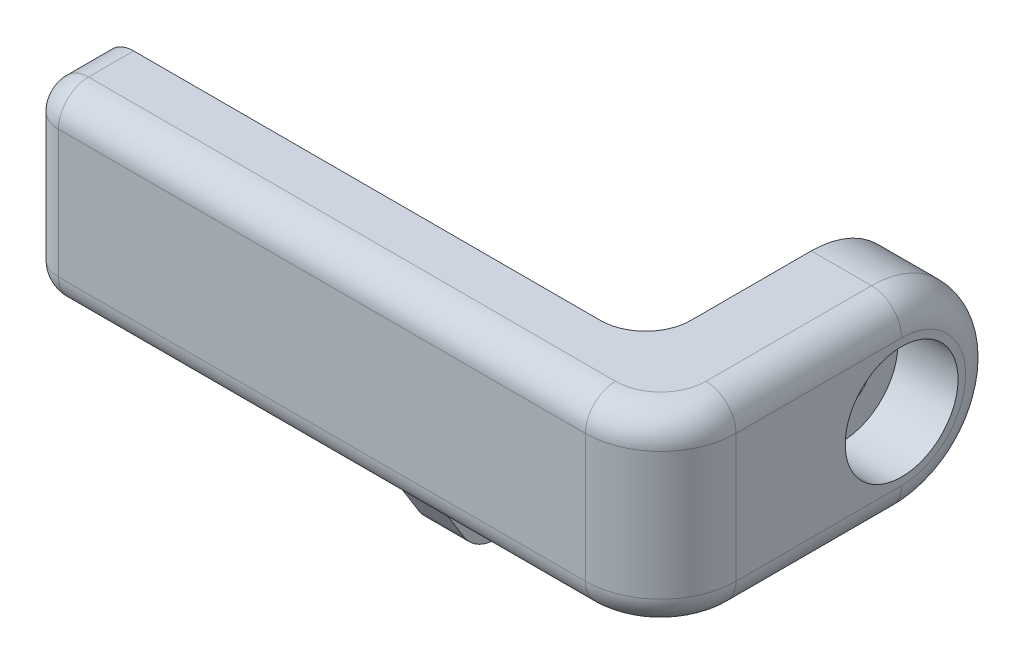
ISO-10303-21;
HEADER;
FILE_DESCRIPTION(('STEP AP214'),'2;1');
FILE_NAME('part.step','',(''),(''),'','','');
FILE_SCHEMA(('AUTOMOTIVE_DESIGN { 1 0 10303 214 1 1 1 1 }'));
ENDSEC;
DATA;
#1=APPLICATION_CONTEXT('core data for automotive mechanical design processes');
#2=APPLICATION_PROTOCOL_DEFINITION('international standard','automotive_design',2000,#1);
#3=PRODUCT_CONTEXT('',#1,'mechanical');
#4=PRODUCT('Part','Part','',(#3));
#5=PRODUCT_RELATED_PRODUCT_CATEGORY('part','',(#4));
#6=PRODUCT_DEFINITION_FORMATION('','',#4);
#7=PRODUCT_DEFINITION_CONTEXT('part definition',#1,'design');
#8=PRODUCT_DEFINITION('design','',#6,#7);
#9=PRODUCT_DEFINITION_SHAPE('','',#8);
#10=(LENGTH_UNIT() NAMED_UNIT(*) SI_UNIT(.MILLI.,.METRE.));
#11=(NAMED_UNIT(*) PLANE_ANGLE_UNIT() SI_UNIT($,.RADIAN.));
#12=(NAMED_UNIT(*) SI_UNIT($,.STERADIAN.) SOLID_ANGLE_UNIT());
#13=UNCERTAINTY_MEASURE_WITH_UNIT(LENGTH_MEASURE(1.E-05),#10,'distance_accuracy_value','');
#14=(GEOMETRIC_REPRESENTATION_CONTEXT(3) GLOBAL_UNCERTAINTY_ASSIGNED_CONTEXT((#13)) GLOBAL_UNIT_ASSIGNED_CONTEXT((#10,
#11,#12)) REPRESENTATION_CONTEXT('',''));
#15=CARTESIAN_POINT('',(0.,0.,0.));
#16=DIRECTION('',(0.,0.,1.));
#17=DIRECTION('',(1.,0.,0.));
#18=AXIS2_PLACEMENT_3D('',#15,#16,#17);
#19=CARTESIAN_POINT('',(0.,-12.5,32.));
#20=DIRECTION('',(0.,1.,0.));
#21=DIRECTION('',(0.,0.,1.));
#22=AXIS2_PLACEMENT_3D('',#19,#20,#21);
#23=PLANE('',#22);
#24=DIRECTION('',(0.,0.,-1.));
#25=VECTOR('',#24,1.);
#26=CARTESIAN_POINT('',(-29.,-12.5,28.));
#27=LINE('',#26,#25);
#28=CARTESIAN_POINT('',(-29.,-12.5,28.));
#29=VERTEX_POINT('',#28);
#30=CARTESIAN_POINT('',(-29.,-12.5,22.));
#31=VERTEX_POINT('',#30);
#32=EDGE_CURVE('E215',#29,#31,#27,.T.);
#33=ORIENTED_EDGE('',*,*,#32,.F.);
#34=DIRECTION('',(1.,0.,0.));
#35=VECTOR('',#34,1.);
#36=CARTESIAN_POINT('',(0.,-12.5,28.));
#37=LINE('',#36,#35);
#38=CARTESIAN_POINT('',(-68.,-12.5,28.));
#39=VERTEX_POINT('',#38);
#40=EDGE_CURVE('E230',#29,#39,#37,.F.);
#41=ORIENTED_EDGE('',*,*,#40,.T.);
#42=DIRECTION('',(0.,0.,1.));
#43=VECTOR('',#42,1.);
#44=CARTESIAN_POINT('',(-68.,-12.5,32.));
#45=LINE('',#44,#43);
#46=CARTESIAN_POINT('',(-68.,-12.5,22.));
#47=VERTEX_POINT('',#46);
#48=EDGE_CURVE('E246',#39,#47,#45,.F.);
#49=ORIENTED_EDGE('',*,*,#48,.T.);
#50=DIRECTION('',(1.,0.,0.));
#51=VECTOR('',#50,1.);
#52=CARTESIAN_POINT('',(-72.,-12.5,22.));
#53=LINE('',#52,#51);
#54=EDGE_CURVE('E233',#47,#31,#53,.T.);
#55=ORIENTED_EDGE('',*,*,#54,.T.);
#56=EDGE_LOOP('',(#33,#41,#49,#55));
#57=FACE_BOUND('',#56,.T.);
#58=ADVANCED_FACE('F45',(#57),#23,.F.);
#59=DIRECTION('',(0.,0.,-1.));
#60=VECTOR('',#59,1.);
#61=CARTESIAN_POINT('',(-23.,-12.5,28.));
#62=LINE('',#61,#60);
#63=CARTESIAN_POINT('',(-23.,-12.5,28.));
#64=VERTEX_POINT('',#63);
#65=CARTESIAN_POINT('',(-23.,-12.5,22.));
#66=VERTEX_POINT('',#65);
#67=EDGE_CURVE('E235',#64,#66,#62,.T.);
#68=ORIENTED_EDGE('',*,*,#67,.T.);
#69=CARTESIAN_POINT('',(-6.00000000000001,-12.5,22.));
#70=VERTEX_POINT('',#69);
#71=EDGE_CURVE('E397',#66,#70,#53,.T.);
#72=ORIENTED_EDGE('',*,*,#71,.T.);
#73=CARTESIAN_POINT('',(-6.00000000000001,-12.5,16.));
#74=DIRECTION('',(0.,1.,0.));
#75=DIRECTION('',(0.,0.,1.));
#76=AXIS2_PLACEMENT_3D('',#73,#74,#75);
#77=CIRCLE('',#76,6.);
#78=CARTESIAN_POINT('',(0.,-12.5,16.));
#79=VERTEX_POINT('',#78);
#80=EDGE_CURVE('E444',#70,#79,#77,.T.);
#81=ORIENTED_EDGE('',*,*,#80,.T.);
#82=DIRECTION('',(0.,0.,-1.));
#83=VECTOR('',#82,1.);
#84=CARTESIAN_POINT('',(0.,-12.5,32.));
#85=LINE('',#84,#83);
#86=CARTESIAN_POINT('',(0.,-12.5,0.));
#87=VERTEX_POINT('',#86);
#88=EDGE_CURVE('E414',#79,#87,#85,.T.);
#89=ORIENTED_EDGE('',*,*,#88,.T.);
#90=DIRECTION('',(1.,0.,0.));
#91=VECTOR('',#90,1.);
#92=CARTESIAN_POINT('',(0.,-12.5,0.));
#93=LINE('',#92,#91);
#94=CARTESIAN_POINT('',(8.,-12.5,0.));
#95=VERTEX_POINT('',#94);
#96=EDGE_CURVE('E403',#87,#95,#93,.T.);
#97=ORIENTED_EDGE('',*,*,#96,.T.);
#98=DIRECTION('',(0.,0.,-1.));
#99=VECTOR('',#98,1.);
#100=CARTESIAN_POINT('',(8.,-12.5,22.));
#101=LINE('',#100,#99);
#102=CARTESIAN_POINT('',(8.,-12.5,22.));
#103=VERTEX_POINT('',#102);
#104=EDGE_CURVE('E257',#95,#103,#101,.F.);
#105=ORIENTED_EDGE('',*,*,#104,.T.);
#106=CARTESIAN_POINT('',(2.,-12.5,22.));
#107=DIRECTION('',(0.,1.,0.));
#108=DIRECTION('',(0.,0.,1.));
#109=AXIS2_PLACEMENT_3D('',#106,#107,#108);
#110=CIRCLE('',#109,6.);
#111=CARTESIAN_POINT('',(2.,-12.5,28.));
#112=VERTEX_POINT('',#111);
#113=EDGE_CURVE('E250',#103,#112,#110,.F.);
#114=ORIENTED_EDGE('',*,*,#113,.T.);
#115=EDGE_CURVE('E245',#112,#64,#37,.F.);
#116=ORIENTED_EDGE('',*,*,#115,.T.);
#117=EDGE_LOOP('',(#68,#72,#81,#89,#97,#105,#114,#116));
#118=FACE_BOUND('',#117,.T.);
#119=ADVANCED_FACE('F541',(#118),#23,.F.);
#120=CARTESIAN_POINT('',(-72.,12.5,22.));
#121=DIRECTION('',(0.,0.,1.));
#122=DIRECTION('',(0.,-1.,0.));
#123=AXIS2_PLACEMENT_3D('',#120,#121,#122);
#124=PLANE('',#123);
#125=DIRECTION('',(0.,-1.,0.));
#126=VECTOR('',#125,1.);
#127=CARTESIAN_POINT('',(-23.,0.,22.));
#128=LINE('',#127,#126);
#129=CARTESIAN_POINT('',(-23.,0.,22.));
#130=VERTEX_POINT('',#129);
#131=EDGE_CURVE('E378',#130,#66,#128,.T.);
#132=ORIENTED_EDGE('',*,*,#131,.F.);
#133=DIRECTION('',(1.,0.,0.));
#134=VECTOR('',#133,1.);
#135=CARTESIAN_POINT('',(-23.,0.,22.));
#136=LINE('',#135,#134);
#137=CARTESIAN_POINT('',(-29.,0.,22.));
#138=VERTEX_POINT('',#137);
#139=EDGE_CURVE('E385',#138,#130,#136,.T.);
#140=ORIENTED_EDGE('',*,*,#139,.F.);
#141=DIRECTION('',(0.,1.,0.));
#142=VECTOR('',#141,1.);
#143=CARTESIAN_POINT('',(-29.,12.5,22.));
#144=LINE('',#143,#142);
#145=EDGE_CURVE('E287',#31,#138,#144,.T.);
#146=ORIENTED_EDGE('',*,*,#145,.F.);
#147=ORIENTED_EDGE('',*,*,#54,.F.);
#148=CARTESIAN_POINT('',(-68.,-8.5,22.));
#149=DIRECTION('',(0.,0.,1.));
#150=DIRECTION('',(0.,-1.,0.));
#151=AXIS2_PLACEMENT_3D('',#148,#149,#150);
#152=CIRCLE('',#151,4.);
#153=CARTESIAN_POINT('',(-72.,-8.49999999999999,22.));
#154=VERTEX_POINT('',#153);
#155=EDGE_CURVE('E284',#47,#154,#152,.F.);
#156=ORIENTED_EDGE('',*,*,#155,.T.);
#157=DIRECTION('',(0.,-1.,0.));
#158=VECTOR('',#157,1.);
#159=CARTESIAN_POINT('',(-72.,12.5,22.));
#160=LINE('',#159,#158);
#161=CARTESIAN_POINT('',(-72.,8.5,22.));
#162=VERTEX_POINT('',#161);
#163=EDGE_CURVE('E331',#162,#154,#160,.T.);
#164=ORIENTED_EDGE('',*,*,#163,.F.);
#165=CARTESIAN_POINT('',(-68.,8.5,22.));
#166=DIRECTION('',(0.,0.,1.));
#167=DIRECTION('',(0.,-1.,0.));
#168=AXIS2_PLACEMENT_3D('',#165,#166,#167);
#169=CIRCLE('',#168,4.);
#170=CARTESIAN_POINT('',(-68.,12.5,22.));
#171=VERTEX_POINT('',#170);
#172=EDGE_CURVE('E281',#162,#171,#169,.F.);
#173=ORIENTED_EDGE('',*,*,#172,.T.);
#174=DIRECTION('',(1.,0.,0.));
#175=VECTOR('',#174,1.);
#176=CARTESIAN_POINT('',(-72.,12.5,22.));
#177=LINE('',#176,#175);
#178=CARTESIAN_POINT('',(-6.00000000000001,12.5,22.));
#179=VERTEX_POINT('',#178);
#180=EDGE_CURVE('E400',#171,#179,#177,.T.);
#181=ORIENTED_EDGE('',*,*,#180,.T.);
#182=DIRECTION('',(0.,-1.,0.));
#183=VECTOR('',#182,1.);
#184=CARTESIAN_POINT('',(-6.00000000000001,-12.5,22.));
#185=LINE('',#184,#183);
#186=EDGE_CURVE('E437',#179,#70,#185,.T.);
#187=ORIENTED_EDGE('',*,*,#186,.T.);
#188=ORIENTED_EDGE('',*,*,#71,.F.);
#189=EDGE_LOOP('',(#132,#140,#146,#147,#156,#164,#173,#181,#187,#188));
#190=FACE_BOUND('',#189,.T.);
#191=ADVANCED_FACE('F522',(#190),#124,.F.);
#192=CARTESIAN_POINT('',(0.,0.,0.));
#193=DIRECTION('',(1.,0.,0.));
#194=DIRECTION('',(0.,0.,-1.));
#195=AXIS2_PLACEMENT_3D('',#192,#193,#194);
#196=PLANE('',#195);
#197=CARTESIAN_POINT('',(0.,0.,0.));
#198=DIRECTION('',(1.,0.,0.));
#199=DIRECTION('',(0.,0.,-1.));
#200=AXIS2_PLACEMENT_3D('',#197,#198,#199);
#201=CIRCLE('',#200,4.);
#202=CARTESIAN_POINT('',(0.,0.,-4.));
#203=VERTEX_POINT('',#202);
#204=EDGE_CURVE('E417',#203,#203,#201,.T.);
#205=ORIENTED_EDGE('',*,*,#204,.T.);
#206=EDGE_LOOP('',(#205));
#207=FACE_BOUND('',#206,.T.);
#208=ORIENTED_EDGE('',*,*,#88,.F.);
#209=DIRECTION('',(0.,-1.,0.));
#210=VECTOR('',#209,1.);
#211=CARTESIAN_POINT('',(0.,12.5,16.));
#212=LINE('',#211,#210);
#213=CARTESIAN_POINT('',(0.,12.5,16.));
#214=VERTEX_POINT('',#213);
#215=EDGE_CURVE('E441',#79,#214,#212,.F.);
#216=ORIENTED_EDGE('',*,*,#215,.T.);
#217=DIRECTION('',(0.,0.,-1.));
#218=VECTOR('',#217,1.);
#219=CARTESIAN_POINT('',(0.,12.5,32.));
#220=LINE('',#219,#218);
#221=CARTESIAN_POINT('',(0.,12.5,0.));
#222=VERTEX_POINT('',#221);
#223=EDGE_CURVE('E410',#214,#222,#220,.T.);
#224=ORIENTED_EDGE('',*,*,#223,.T.);
#225=CARTESIAN_POINT('',(0.,0.,0.));
#226=DIRECTION('',(1.,0.,0.));
#227=DIRECTION('',(0.,0.,-1.));
#228=AXIS2_PLACEMENT_3D('',#225,#226,#227);
#229=CIRCLE('',#228,12.5);
#230=EDGE_CURVE('E422',#87,#222,#229,.T.);
#231=ORIENTED_EDGE('',*,*,#230,.F.);
#232=EDGE_LOOP('',(#208,#216,#224,#231));
#233=FACE_BOUND('',#232,.T.);
#234=ADVANCED_FACE('F564',(#207,#233),#196,.F.);
#235=CARTESIAN_POINT('',(12.,0.,0.));
#236=DIRECTION('',(1.,0.,0.));
#237=DIRECTION('',(0.,0.,-1.));
#238=AXIS2_PLACEMENT_3D('',#235,#236,#237);
#239=PLANE('',#238);
#240=DIRECTION('',(0.,1.,0.));
#241=VECTOR('',#240,1.);
#242=CARTESIAN_POINT('',(12.,-12.5,22.));
#243=LINE('',#242,#241);
#244=CARTESIAN_POINT('',(12.,8.5,22.));
#245=VERTEX_POINT('',#244);
#246=CARTESIAN_POINT('',(12.,-8.5,22.));
#247=VERTEX_POINT('',#246);
#248=EDGE_CURVE('E455',#245,#247,#243,.F.);
#249=ORIENTED_EDGE('',*,*,#248,.T.);
#250=DIRECTION('',(0.,0.,-1.));
#251=VECTOR('',#250,1.);
#252=CARTESIAN_POINT('',(12.,-8.5,0.));
#253=LINE('',#252,#251);
#254=CARTESIAN_POINT('',(12.,-8.5,0.));
#255=VERTEX_POINT('',#254);
#256=EDGE_CURVE('E266',#247,#255,#253,.T.);
#257=ORIENTED_EDGE('',*,*,#256,.T.);
#258=CARTESIAN_POINT('',(12.,0.,0.));
#259=DIRECTION('',(1.,0.,0.));
#260=DIRECTION('',(0.,0.,-1.));
#261=AXIS2_PLACEMENT_3D('',#258,#259,#260);
#262=CIRCLE('',#261,8.5);
#263=CARTESIAN_POINT('',(12.,8.5,0.));
#264=VERTEX_POINT('',#263);
#265=EDGE_CURVE('E263',#255,#264,#262,.T.);
#266=ORIENTED_EDGE('',*,*,#265,.T.);
#267=DIRECTION('',(0.,0.,-1.));
#268=VECTOR('',#267,1.);
#269=CARTESIAN_POINT('',(12.,8.5,22.));
#270=LINE('',#269,#268);
#271=EDGE_CURVE('E260',#264,#245,#270,.F.);
#272=ORIENTED_EDGE('',*,*,#271,.T.);
#273=EDGE_LOOP('',(#249,#257,#266,#272));
#274=FACE_BOUND('',#273,.T.);
#275=CARTESIAN_POINT('',(12.,0.,0.));
#276=DIRECTION('',(1.,0.,0.));
#277=DIRECTION('',(0.,0.,-1.));
#278=AXIS2_PLACEMENT_3D('',#275,#276,#277);
#279=CIRCLE('',#278,7.5);
#280=CARTESIAN_POINT('',(12.,0.,-7.5));
#281=VERTEX_POINT('',#280);
#282=EDGE_CURVE('E426',#281,#281,#279,.T.);
#283=ORIENTED_EDGE('',*,*,#282,.F.);
#284=EDGE_LOOP('',(#283));
#285=FACE_BOUND('',#284,.T.);
#286=ADVANCED_FACE('F560',(#274,#285),#239,.T.);
#287=CARTESIAN_POINT('',(12.,0.,0.));
#288=DIRECTION('',(-1.,0.,0.));
#289=DIRECTION('',(0.,0.,1.));
#290=AXIS2_PLACEMENT_3D('',#287,#288,#289);
#291=CYLINDRICAL_SURFACE('',#290,7.5);
#292=ORIENTED_EDGE('',*,*,#282,.T.);
#293=EDGE_LOOP('',(#292));
#294=FACE_BOUND('',#293,.T.);
#295=CARTESIAN_POINT('',(4.,0.,0.));
#296=DIRECTION('',(1.,0.,0.));
#297=DIRECTION('',(0.,0.,-1.));
#298=AXIS2_PLACEMENT_3D('',#295,#296,#297);
#299=CIRCLE('',#298,7.5);
#300=CARTESIAN_POINT('',(4.,0.,-7.5));
#301=VERTEX_POINT('',#300);
#302=EDGE_CURVE('E430',#301,#301,#299,.T.);
#303=ORIENTED_EDGE('',*,*,#302,.F.);
#304=EDGE_LOOP('',(#303));
#305=FACE_BOUND('',#304,.T.);
#306=ADVANCED_FACE('F563',(#294,#305),#291,.F.);
#307=CARTESIAN_POINT('',(12.,0.,0.));
#308=DIRECTION('',(-1.,0.,0.));
#309=DIRECTION('',(0.,0.,1.));
#310=AXIS2_PLACEMENT_3D('',#307,#308,#309);
#311=CYLINDRICAL_SURFACE('',#310,12.5);
#312=DIRECTION('',(-1.,0.,0.));
#313=VECTOR('',#312,1.);
#314=CARTESIAN_POINT('',(0.,12.5,0.));
#315=LINE('',#314,#313);
#316=CARTESIAN_POINT('',(8.,12.5,0.));
#317=VERTEX_POINT('',#316);
#318=EDGE_CURVE('E407',#317,#222,#315,.T.);
#319=ORIENTED_EDGE('',*,*,#318,.F.);
#320=CARTESIAN_POINT('',(8.,0.,0.));
#321=DIRECTION('',(1.,0.,0.));
#322=DIRECTION('',(0.,0.,-1.));
#323=AXIS2_PLACEMENT_3D('',#320,#321,#322);
#324=CIRCLE('',#323,12.5);
#325=EDGE_CURVE('E269',#317,#95,#324,.F.);
#326=ORIENTED_EDGE('',*,*,#325,.T.);
#327=ORIENTED_EDGE('',*,*,#96,.F.);
#328=ORIENTED_EDGE('',*,*,#230,.T.);
#329=EDGE_LOOP('',(#319,#326,#327,#328));
#330=FACE_BOUND('',#329,.T.);
#331=ADVANCED_FACE('F558',(#330),#311,.T.);
#332=CARTESIAN_POINT('',(4.,0.,0.));
#333=DIRECTION('',(-1.,0.,0.));
#334=DIRECTION('',(0.,0.,1.));
#335=AXIS2_PLACEMENT_3D('',#332,#333,#334);
#336=CYLINDRICAL_SURFACE('',#335,4.);
#337=CARTESIAN_POINT('',(4.,0.,0.));
#338=DIRECTION('',(1.,0.,0.));
#339=DIRECTION('',(0.,0.,-1.));
#340=AXIS2_PLACEMENT_3D('',#337,#338,#339);
#341=CIRCLE('',#340,4.);
#342=CARTESIAN_POINT('',(4.,0.,-4.));
#343=VERTEX_POINT('',#342);
#344=EDGE_CURVE('E418',#343,#343,#341,.T.);
#345=ORIENTED_EDGE('',*,*,#344,.T.);
#346=EDGE_LOOP('',(#345));
#347=FACE_BOUND('',#346,.T.);
#348=ORIENTED_EDGE('',*,*,#204,.F.);
#349=EDGE_LOOP('',(#348));
#350=FACE_BOUND('',#349,.T.);
#351=ADVANCED_FACE('F554',(#347,#350),#336,.F.);
#352=CARTESIAN_POINT('',(4.,0.,0.));
#353=DIRECTION('',(1.,0.,0.));
#354=DIRECTION('',(0.,0.,-1.));
#355=AXIS2_PLACEMENT_3D('',#352,#353,#354);
#356=PLANE('',#355);
#357=ORIENTED_EDGE('',*,*,#302,.T.);
#358=EDGE_LOOP('',(#357));
#359=FACE_BOUND('',#358,.T.);
#360=ORIENTED_EDGE('',*,*,#344,.F.);
#361=EDGE_LOOP('',(#360));
#362=FACE_BOUND('',#361,.T.);
#363=ADVANCED_FACE('F551',(#359,#362),#356,.T.);
#364=CARTESIAN_POINT('',(0.,12.5,32.));
#365=DIRECTION('',(0.,-1.,0.));
#366=DIRECTION('',(0.,0.,-1.));
#367=AXIS2_PLACEMENT_3D('',#364,#365,#366);
#368=PLANE('',#367);
#369=ORIENTED_EDGE('',*,*,#180,.F.);
#370=DIRECTION('',(0.,0.,-1.));
#371=VECTOR('',#370,1.);
#372=CARTESIAN_POINT('',(-68.,12.5,32.));
#373=LINE('',#372,#371);
#374=CARTESIAN_POINT('',(-68.,12.5,28.));
#375=VERTEX_POINT('',#374);
#376=EDGE_CURVE('E479',#171,#375,#373,.F.);
#377=ORIENTED_EDGE('',*,*,#376,.T.);
#378=DIRECTION('',(-1.,0.,0.));
#379=VECTOR('',#378,1.);
#380=CARTESIAN_POINT('',(0.,12.5,28.));
#381=LINE('',#380,#379);
#382=CARTESIAN_POINT('',(2.,12.5,28.));
#383=VERTEX_POINT('',#382);
#384=EDGE_CURVE('E475',#375,#383,#381,.F.);
#385=ORIENTED_EDGE('',*,*,#384,.T.);
#386=CARTESIAN_POINT('',(2.,12.5,22.));
#387=DIRECTION('',(0.,-1.,0.));
#388=DIRECTION('',(0.,0.,-1.));
#389=AXIS2_PLACEMENT_3D('',#386,#387,#388);
#390=CIRCLE('',#389,6.);
#391=CARTESIAN_POINT('',(8.,12.5,22.));
#392=VERTEX_POINT('',#391);
#393=EDGE_CURVE('E472',#383,#392,#390,.F.);
#394=ORIENTED_EDGE('',*,*,#393,.T.);
#395=DIRECTION('',(0.,0.,-1.));
#396=VECTOR('',#395,1.);
#397=CARTESIAN_POINT('',(8.,12.5,0.));
#398=LINE('',#397,#396);
#399=EDGE_CURVE('E469',#392,#317,#398,.T.);
#400=ORIENTED_EDGE('',*,*,#399,.T.);
#401=ORIENTED_EDGE('',*,*,#318,.T.);
#402=ORIENTED_EDGE('',*,*,#223,.F.);
#403=CARTESIAN_POINT('',(-6.00000000000001,12.5,16.));
#404=DIRECTION('',(0.,-1.,0.));
#405=DIRECTION('',(0.,0.,-1.));
#406=AXIS2_PLACEMENT_3D('',#403,#404,#405);
#407=CIRCLE('',#406,6.);
#408=EDGE_CURVE('E447',#214,#179,#407,.T.);
#409=ORIENTED_EDGE('',*,*,#408,.T.);
#410=EDGE_LOOP('',(#369,#377,#385,#394,#400,#401,#402,#409));
#411=FACE_BOUND('',#410,.T.);
#412=ADVANCED_FACE('F549',(#411),#368,.F.);
#413=CARTESIAN_POINT('',(0.,0.,32.));
#414=DIRECTION('',(0.,0.,-1.));
#415=DIRECTION('',(-1.,0.,0.));
#416=AXIS2_PLACEMENT_3D('',#413,#414,#415);
#417=PLANE('',#416);
#418=DIRECTION('',(0.,1.,0.));
#419=VECTOR('',#418,1.);
#420=CARTESIAN_POINT('',(2.,12.5,32.));
#421=LINE('',#420,#419);
#422=CARTESIAN_POINT('',(2.,-8.5,32.));
#423=VERTEX_POINT('',#422);
#424=CARTESIAN_POINT('',(2.,8.5,32.));
#425=VERTEX_POINT('',#424);
#426=EDGE_CURVE('E451',#423,#425,#421,.T.);
#427=ORIENTED_EDGE('',*,*,#426,.T.);
#428=DIRECTION('',(-1.,0.,0.));
#429=VECTOR('',#428,1.);
#430=CARTESIAN_POINT('',(0.,8.5,32.));
#431=LINE('',#430,#429);
#432=CARTESIAN_POINT('',(-68.,8.5,32.));
#433=VERTEX_POINT('',#432);
#434=EDGE_CURVE('E465',#425,#433,#431,.T.);
#435=ORIENTED_EDGE('',*,*,#434,.T.);
#436=DIRECTION('',(0.,1.,0.));
#437=VECTOR('',#436,1.);
#438=CARTESIAN_POINT('',(-68.,0.,32.));
#439=LINE('',#438,#437);
#440=CARTESIAN_POINT('',(-68.,-8.5,32.));
#441=VERTEX_POINT('',#440);
#442=EDGE_CURVE('E459',#433,#441,#439,.F.);
#443=ORIENTED_EDGE('',*,*,#442,.T.);
#444=DIRECTION('',(1.,0.,0.));
#445=VECTOR('',#444,1.);
#446=CARTESIAN_POINT('',(0.,-8.5,32.));
#447=LINE('',#446,#445);
#448=EDGE_CURVE('E462',#441,#423,#447,.T.);
#449=ORIENTED_EDGE('',*,*,#448,.T.);
#450=EDGE_LOOP('',(#427,#435,#443,#449));
#451=FACE_BOUND('',#450,.T.);
#452=ADVANCED_FACE('F495',(#451),#417,.F.);
#453=CARTESIAN_POINT('',(-72.,0.,0.));
#454=DIRECTION('',(1.,0.,0.));
#455=DIRECTION('',(0.,0.,-1.));
#456=AXIS2_PLACEMENT_3D('',#453,#454,#455);
#457=PLANE('',#456);
#458=ORIENTED_EDGE('',*,*,#163,.T.);
#459=DIRECTION('',(0.,0.,1.));
#460=VECTOR('',#459,1.);
#461=CARTESIAN_POINT('',(-72.,-8.5,0.));
#462=LINE('',#461,#460);
#463=CARTESIAN_POINT('',(-72.,-8.5,28.));
#464=VERTEX_POINT('',#463);
#465=EDGE_CURVE('E278',#154,#464,#462,.T.);
#466=ORIENTED_EDGE('',*,*,#465,.T.);
#467=DIRECTION('',(0.,1.,0.));
#468=VECTOR('',#467,1.);
#469=CARTESIAN_POINT('',(-72.,0.,28.));
#470=LINE('',#469,#468);
#471=CARTESIAN_POINT('',(-72.,8.5,28.));
#472=VERTEX_POINT('',#471);
#473=EDGE_CURVE('E272',#464,#472,#470,.T.);
#474=ORIENTED_EDGE('',*,*,#473,.T.);
#475=DIRECTION('',(0.,0.,-1.));
#476=VECTOR('',#475,1.);
#477=CARTESIAN_POINT('',(-72.,8.5,0.));
#478=LINE('',#477,#476);
#479=EDGE_CURVE('E275',#472,#162,#478,.T.);
#480=ORIENTED_EDGE('',*,*,#479,.T.);
#481=EDGE_LOOP('',(#458,#466,#474,#480));
#482=FACE_BOUND('',#481,.T.);
#483=ADVANCED_FACE('F578',(#482),#457,.F.);
#484=CARTESIAN_POINT('',(-6.00000000000001,12.5,16.));
#485=DIRECTION('',(0.,1.,0.));
#486=DIRECTION('',(0.,0.,1.));
#487=AXIS2_PLACEMENT_3D('',#484,#485,#486);
#488=CYLINDRICAL_SURFACE('',#487,6.);
#489=ORIENTED_EDGE('',*,*,#408,.F.);
#490=ORIENTED_EDGE('',*,*,#215,.F.);
#491=ORIENTED_EDGE('',*,*,#80,.F.);
#492=ORIENTED_EDGE('',*,*,#186,.F.);
#493=EDGE_LOOP('',(#489,#490,#491,#492));
#494=FACE_BOUND('',#493,.T.);
#495=ADVANCED_FACE('F575',(#494),#488,.F.);
#496=CARTESIAN_POINT('',(2.,0.,22.));
#497=DIRECTION('',(0.,-1.,0.));
#498=DIRECTION('',(0.,0.,-1.));
#499=AXIS2_PLACEMENT_3D('',#496,#497,#498);
#500=CYLINDRICAL_SURFACE('',#499,10.);
#501=ORIENTED_EDGE('',*,*,#248,.F.);
#502=CARTESIAN_POINT('',(2.,8.5,22.));
#503=DIRECTION('',(0.,-1.,0.));
#504=DIRECTION('',(0.,0.,-1.));
#505=AXIS2_PLACEMENT_3D('',#502,#503,#504);
#506=CIRCLE('',#505,10.);
#507=EDGE_CURVE('E251',#245,#425,#506,.T.);
#508=ORIENTED_EDGE('',*,*,#507,.T.);
#509=ORIENTED_EDGE('',*,*,#426,.F.);
#510=CARTESIAN_POINT('',(2.,-8.5,22.));
#511=DIRECTION('',(0.,1.,0.));
#512=DIRECTION('',(0.,0.,1.));
#513=AXIS2_PLACEMENT_3D('',#510,#511,#512);
#514=CIRCLE('',#513,10.);
#515=EDGE_CURVE('E482',#423,#247,#514,.T.);
#516=ORIENTED_EDGE('',*,*,#515,.T.);
#517=EDGE_LOOP('',(#501,#508,#509,#516));
#518=FACE_BOUND('',#517,.T.);
#519=ADVANCED_FACE('F489',(#518),#500,.T.);
#520=CARTESIAN_POINT('',(2.,-8.5,22.));
#521=DIRECTION('',(0.,1.,0.));
#522=DIRECTION('',(0.,0.,1.));
#523=AXIS2_PLACEMENT_3D('',#520,#521,#522);
#524=TOROIDAL_SURFACE('',#523,6.,4.);
#525=CARTESIAN_POINT('',(2.,-8.5,28.));
#526=DIRECTION('',(-1.,0.,0.));
#527=DIRECTION('',(0.,0.,1.));
#528=AXIS2_PLACEMENT_3D('',#525,#526,#527);
#529=CIRCLE('',#528,4.);
#530=EDGE_CURVE('E324',#112,#423,#529,.T.);
#531=ORIENTED_EDGE('',*,*,#530,.F.);
#532=ORIENTED_EDGE('',*,*,#113,.F.);
#533=CARTESIAN_POINT('',(8.,-8.5,22.));
#534=DIRECTION('',(0.,0.,-1.));
#535=DIRECTION('',(-1.,0.,0.));
#536=AXIS2_PLACEMENT_3D('',#533,#534,#535);
#537=CIRCLE('',#536,4.);
#538=EDGE_CURVE('E327',#247,#103,#537,.T.);
#539=ORIENTED_EDGE('',*,*,#538,.F.);
#540=ORIENTED_EDGE('',*,*,#515,.F.);
#541=EDGE_LOOP('',(#531,#532,#539,#540));
#542=FACE_BOUND('',#541,.T.);
#543=ADVANCED_FACE('F581',(#542),#524,.T.);
#544=CARTESIAN_POINT('',(8.,-8.5,0.));
#545=DIRECTION('',(0.,0.,1.));
#546=DIRECTION('',(1.,0.,0.));
#547=AXIS2_PLACEMENT_3D('',#544,#545,#546);
#548=CYLINDRICAL_SURFACE('',#547,4.);
#549=ORIENTED_EDGE('',*,*,#538,.T.);
#550=ORIENTED_EDGE('',*,*,#104,.F.);
#551=CARTESIAN_POINT('',(8.,-8.5,0.));
#552=DIRECTION('',(0.,0.,-1.));
#553=DIRECTION('',(-1.,0.,0.));
#554=AXIS2_PLACEMENT_3D('',#551,#552,#553);
#555=CIRCLE('',#554,4.);
#556=EDGE_CURVE('E320',#255,#95,#555,.T.);
#557=ORIENTED_EDGE('',*,*,#556,.F.);
#558=ORIENTED_EDGE('',*,*,#256,.F.);
#559=EDGE_LOOP('',(#549,#550,#557,#558));
#560=FACE_BOUND('',#559,.T.);
#561=ADVANCED_FACE('F607',(#560),#548,.T.);
#562=CARTESIAN_POINT('',(0.,-8.5,28.));
#563=DIRECTION('',(1.,0.,0.));
#564=DIRECTION('',(0.,0.,-1.));
#565=AXIS2_PLACEMENT_3D('',#562,#563,#564);
#566=CYLINDRICAL_SURFACE('',#565,4.);
#567=ORIENTED_EDGE('',*,*,#530,.T.);
#568=ORIENTED_EDGE('',*,*,#448,.F.);
#569=CARTESIAN_POINT('',(-68.,-8.5,28.));
#570=DIRECTION('',(-1.,0.,0.));
#571=DIRECTION('',(0.,0.,1.));
#572=AXIS2_PLACEMENT_3D('',#569,#570,#571);
#573=CIRCLE('',#572,4.);
#574=EDGE_CURVE('E242',#39,#441,#573,.T.);
#575=ORIENTED_EDGE('',*,*,#574,.F.);
#576=ORIENTED_EDGE('',*,*,#40,.F.);
#577=DIRECTION('',(-1.,0.,0.));
#578=VECTOR('',#577,1.);
#579=CARTESIAN_POINT('',(-29.,-12.5,28.));
#580=LINE('',#579,#578);
#581=EDGE_CURVE('E202',#64,#29,#580,.T.);
#582=ORIENTED_EDGE('',*,*,#581,.F.);
#583=ORIENTED_EDGE('',*,*,#115,.F.);
#584=EDGE_LOOP('',(#567,#568,#575,#576,#582,#583));
#585=FACE_BOUND('',#584,.T.);
#586=ADVANCED_FACE('F239',(#585),#566,.T.);
#587=CARTESIAN_POINT('',(-68.,-8.5,0.));
#588=DIRECTION('',(0.,0.,1.));
#589=DIRECTION('',(1.,0.,0.));
#590=AXIS2_PLACEMENT_3D('',#587,#588,#589);
#591=CYLINDRICAL_SURFACE('',#590,4.);
#592=ORIENTED_EDGE('',*,*,#155,.F.);
#593=ORIENTED_EDGE('',*,*,#48,.F.);
#594=CARTESIAN_POINT('',(-68.,-8.5,28.));
#595=DIRECTION('',(0.,0.,1.));
#596=DIRECTION('',(1.,0.,0.));
#597=AXIS2_PLACEMENT_3D('',#594,#595,#596);
#598=CIRCLE('',#597,4.);
#599=EDGE_CURVE('E315',#464,#39,#598,.T.);
#600=ORIENTED_EDGE('',*,*,#599,.F.);
#601=ORIENTED_EDGE('',*,*,#465,.F.);
#602=EDGE_LOOP('',(#592,#593,#600,#601));
#603=FACE_BOUND('',#602,.T.);
#604=ADVANCED_FACE('F519',(#603),#591,.T.);
#605=CARTESIAN_POINT('',(8.,0.,0.));
#606=DIRECTION('',(1.,0.,0.));
#607=DIRECTION('',(0.,0.,-1.));
#608=AXIS2_PLACEMENT_3D('',#605,#606,#607);
#609=TOROIDAL_SURFACE('',#608,8.5,4.);
#610=ORIENTED_EDGE('',*,*,#556,.T.);
#611=ORIENTED_EDGE('',*,*,#325,.F.);
#612=CARTESIAN_POINT('',(8.,8.5,0.));
#613=DIRECTION('',(0.,0.,1.));
#614=DIRECTION('',(1.,0.,0.));
#615=AXIS2_PLACEMENT_3D('',#612,#613,#614);
#616=CIRCLE('',#615,4.);
#617=EDGE_CURVE('E311',#264,#317,#616,.T.);
#618=ORIENTED_EDGE('',*,*,#617,.F.);
#619=ORIENTED_EDGE('',*,*,#265,.F.);
#620=EDGE_LOOP('',(#610,#611,#618,#619));
#621=FACE_BOUND('',#620,.T.);
#622=ADVANCED_FACE('F599',(#621),#609,.T.);
#623=CARTESIAN_POINT('',(-68.,-8.5,28.));
#624=DIRECTION('',(0.,-1.,0.));
#625=DIRECTION('',(0.,0.,-1.));
#626=AXIS2_PLACEMENT_3D('',#623,#624,#625);
#627=SPHERICAL_SURFACE('',#626,4.);
#628=ORIENTED_EDGE('',*,*,#599,.T.);
#629=ORIENTED_EDGE('',*,*,#574,.T.);
#630=CARTESIAN_POINT('',(-68.,-8.5,28.));
#631=DIRECTION('',(0.,-1.,0.));
#632=DIRECTION('',(0.,0.,-1.));
#633=AXIS2_PLACEMENT_3D('',#630,#631,#632);
#634=CIRCLE('',#633,4.);
#635=EDGE_CURVE('E307',#464,#441,#634,.F.);
#636=ORIENTED_EDGE('',*,*,#635,.F.);
#637=EDGE_LOOP('',(#628,#629,#636));
#638=FACE_BOUND('',#637,.T.);
#639=ADVANCED_FACE('F514',(#638),#627,.T.);
#640=CARTESIAN_POINT('',(8.,8.5,32.));
#641=DIRECTION('',(0.,0.,1.));
#642=DIRECTION('',(1.,0.,0.));
#643=AXIS2_PLACEMENT_3D('',#640,#641,#642);
#644=CYLINDRICAL_SURFACE('',#643,4.);
#645=ORIENTED_EDGE('',*,*,#617,.T.);
#646=ORIENTED_EDGE('',*,*,#399,.F.);
#647=CARTESIAN_POINT('',(8.,8.5,22.));
#648=DIRECTION('',(0.,0.,1.));
#649=DIRECTION('',(1.,0.,0.));
#650=AXIS2_PLACEMENT_3D('',#647,#648,#649);
#651=CIRCLE('',#650,4.);
#652=EDGE_CURVE('E303',#245,#392,#651,.T.);
#653=ORIENTED_EDGE('',*,*,#652,.F.);
#654=ORIENTED_EDGE('',*,*,#271,.F.);
#655=EDGE_LOOP('',(#645,#646,#653,#654));
#656=FACE_BOUND('',#655,.T.);
#657=ADVANCED_FACE('F593',(#656),#644,.T.);
#658=CARTESIAN_POINT('',(-68.,0.,28.));
#659=DIRECTION('',(0.,1.,0.));
#660=DIRECTION('',(0.,0.,1.));
#661=AXIS2_PLACEMENT_3D('',#658,#659,#660);
#662=CYLINDRICAL_SURFACE('',#661,4.);
#663=ORIENTED_EDGE('',*,*,#635,.T.);
#664=ORIENTED_EDGE('',*,*,#442,.F.);
#665=CARTESIAN_POINT('',(-68.,8.5,28.));
#666=DIRECTION('',(0.,1.,0.));
#667=DIRECTION('',(0.,0.,1.));
#668=AXIS2_PLACEMENT_3D('',#665,#666,#667);
#669=CIRCLE('',#668,4.);
#670=EDGE_CURVE('E299',#472,#433,#669,.T.);
#671=ORIENTED_EDGE('',*,*,#670,.F.);
#672=ORIENTED_EDGE('',*,*,#473,.F.);
#673=EDGE_LOOP('',(#663,#664,#671,#672));
#674=FACE_BOUND('',#673,.T.);
#675=ADVANCED_FACE('F510',(#674),#662,.T.);
#676=CARTESIAN_POINT('',(-68.,8.5,0.));
#677=DIRECTION('',(0.,0.,-1.));
#678=DIRECTION('',(-1.,0.,0.));
#679=AXIS2_PLACEMENT_3D('',#676,#677,#678);
#680=CYLINDRICAL_SURFACE('',#679,4.);
#681=ORIENTED_EDGE('',*,*,#172,.F.);
#682=ORIENTED_EDGE('',*,*,#479,.F.);
#683=CARTESIAN_POINT('',(-68.,8.5,28.));
#684=DIRECTION('',(0.,0.,1.));
#685=DIRECTION('',(1.,0.,0.));
#686=AXIS2_PLACEMENT_3D('',#683,#684,#685);
#687=CIRCLE('',#686,4.);
#688=EDGE_CURVE('E295',#375,#472,#687,.T.);
#689=ORIENTED_EDGE('',*,*,#688,.F.);
#690=ORIENTED_EDGE('',*,*,#376,.F.);
#691=EDGE_LOOP('',(#681,#682,#689,#690));
#692=FACE_BOUND('',#691,.T.);
#693=ADVANCED_FACE('F587',(#692),#680,.T.);
#694=CARTESIAN_POINT('',(2.,8.5,22.));
#695=DIRECTION('',(0.,-1.,0.));
#696=DIRECTION('',(0.,0.,-1.));
#697=AXIS2_PLACEMENT_3D('',#694,#695,#696);
#698=TOROIDAL_SURFACE('',#697,6.,4.);
#699=ORIENTED_EDGE('',*,*,#652,.T.);
#700=ORIENTED_EDGE('',*,*,#393,.F.);
#701=CARTESIAN_POINT('',(2.,8.5,28.));
#702=DIRECTION('',(-1.,0.,0.));
#703=DIRECTION('',(0.,0.,1.));
#704=AXIS2_PLACEMENT_3D('',#701,#702,#703);
#705=CIRCLE('',#704,4.);
#706=EDGE_CURVE('E291',#425,#383,#705,.T.);
#707=ORIENTED_EDGE('',*,*,#706,.F.);
#708=ORIENTED_EDGE('',*,*,#507,.F.);
#709=EDGE_LOOP('',(#699,#700,#707,#708));
#710=FACE_BOUND('',#709,.T.);
#711=ADVANCED_FACE('F498',(#710),#698,.T.);
#712=CARTESIAN_POINT('',(-68.,8.5,28.));
#713=DIRECTION('',(-1.,0.,0.));
#714=DIRECTION('',(0.,0.,1.));
#715=AXIS2_PLACEMENT_3D('',#712,#713,#714);
#716=SPHERICAL_SURFACE('',#715,4.);
#717=ORIENTED_EDGE('',*,*,#688,.T.);
#718=ORIENTED_EDGE('',*,*,#670,.T.);
#719=CARTESIAN_POINT('',(-68.,8.5,28.));
#720=DIRECTION('',(-1.,0.,0.));
#721=DIRECTION('',(0.,0.,1.));
#722=AXIS2_PLACEMENT_3D('',#719,#720,#721);
#723=CIRCLE('',#722,4.);
#724=EDGE_CURVE('E288',#375,#433,#723,.F.);
#725=ORIENTED_EDGE('',*,*,#724,.F.);
#726=EDGE_LOOP('',(#717,#718,#725));
#727=FACE_BOUND('',#726,.T.);
#728=ADVANCED_FACE('F506',(#727),#716,.T.);
#729=CARTESIAN_POINT('',(0.,8.5,28.));
#730=DIRECTION('',(-1.,0.,0.));
#731=DIRECTION('',(0.,0.,1.));
#732=AXIS2_PLACEMENT_3D('',#729,#730,#731);
#733=CYLINDRICAL_SURFACE('',#732,4.);
#734=ORIENTED_EDGE('',*,*,#706,.T.);
#735=ORIENTED_EDGE('',*,*,#384,.F.);
#736=ORIENTED_EDGE('',*,*,#724,.T.);
#737=ORIENTED_EDGE('',*,*,#434,.F.);
#738=EDGE_LOOP('',(#734,#735,#736,#737));
#739=FACE_BOUND('',#738,.T.);
#740=ADVANCED_FACE('F501',(#739),#733,.T.);
#741=CARTESIAN_POINT('',(-23.,0.,-13.));
#742=DIRECTION('',(-1.,0.,0.));
#743=DIRECTION('',(0.,-1.,0.));
#744=AXIS2_PLACEMENT_3D('',#741,#742,#743);
#745=PLANE('',#744);
#746=DIRECTION('',(0.,0.849407893683524,0.527736894814186));
#747=VECTOR('',#746,1.);
#748=CARTESIAN_POINT('',(-23.,-12.5,28.));
#749=LINE('',#748,#747);
#750=CARTESIAN_POINT('',(-23.,-20.3697624649736,23.1105187071198));
#751=VERTEX_POINT('',#750);
#752=EDGE_CURVE('E208',#751,#64,#749,.T.);
#753=ORIENTED_EDGE('',*,*,#752,.F.);
#754=CARTESIAN_POINT('',(-23.,-17.7310779909026,18.8634792387022));
#755=DIRECTION('',(-1.,0.,0.));
#756=DIRECTION('',(0.,-1.,0.));
#757=AXIS2_PLACEMENT_3D('',#754,#755,#756);
#758=CIRCLE('',#757,5.);
#759=CARTESIAN_POINT('',(-23.,-22.7310779909026,18.8634792387022));
#760=VERTEX_POINT('',#759);
#761=EDGE_CURVE('E356',#751,#760,#758,.F.);
#762=ORIENTED_EDGE('',*,*,#761,.T.);
#763=DIRECTION('',(0.,0.,1.));
#764=VECTOR('',#763,1.);
#765=CARTESIAN_POINT('',(-23.,-22.7310779909026,21.6434340089469));
#766=LINE('',#765,#764);
#767=CARTESIAN_POINT('',(-23.,-22.7310779909026,8.93024193266688));
#768=VERTEX_POINT('',#767);
#769=EDGE_CURVE('E226',#768,#760,#766,.T.);
#770=ORIENTED_EDGE('',*,*,#769,.F.);
#771=CARTESIAN_POINT('',(-23.,-17.7310779909026,8.93024193266688));
#772=DIRECTION('',(-1.,0.,0.));
#773=DIRECTION('',(0.,-1.,0.));
#774=AXIS2_PLACEMENT_3D('',#771,#772,#773);
#775=CIRCLE('',#774,5.);
#776=CARTESIAN_POINT('',(-23.,-15.0923935168317,4.68320246424926));
#777=VERTEX_POINT('',#776);
#778=EDGE_CURVE('E67',#768,#777,#775,.F.);
#779=ORIENTED_EDGE('',*,*,#778,.T.);
#780=DIRECTION('',(0.,-0.849407893683524,-0.527736894814186));
#781=VECTOR('',#780,1.);
#782=CARTESIAN_POINT('',(-23.,-30.0780645688599,-4.62739091087046));
#783=LINE('',#782,#781);
#784=CARTESIAN_POINT('',(-23.,-2.36131552592906,12.5930177797394));
#785=VERTEX_POINT('',#784);
#786=EDGE_CURVE('E370',#785,#777,#783,.T.);
#787=ORIENTED_EDGE('',*,*,#786,.F.);
#788=CARTESIAN_POINT('',(-23.,-5.,16.8400572481571));
#789=DIRECTION('',(-1.,0.,0.));
#790=DIRECTION('',(0.,-1.,0.));
#791=AXIS2_PLACEMENT_3D('',#788,#789,#790);
#792=CIRCLE('',#791,5.);
#793=CARTESIAN_POINT('',(-23.,0.,16.8400572481571));
#794=VERTEX_POINT('',#793);
#795=EDGE_CURVE('E61',#785,#794,#792,.F.);
#796=ORIENTED_EDGE('',*,*,#795,.T.);
#797=DIRECTION('',(0.,0.,1.));
#798=VECTOR('',#797,1.);
#799=CARTESIAN_POINT('',(-23.,0.,-13.));
#800=LINE('',#799,#798);
#801=EDGE_CURVE('E389',#794,#130,#800,.T.);
#802=ORIENTED_EDGE('',*,*,#801,.T.);
#803=ORIENTED_EDGE('',*,*,#131,.T.);
#804=ORIENTED_EDGE('',*,*,#67,.F.);
#805=EDGE_LOOP('',(#753,#762,#770,#779,#787,#796,#802,#803,#804));
#806=FACE_BOUND('',#805,.T.);
#807=ADVANCED_FACE('F529',(#806),#745,.F.);
#808=CARTESIAN_POINT('',(-29.,0.,-13.));
#809=DIRECTION('',(1.,0.,0.));
#810=DIRECTION('',(0.,1.,0.));
#811=AXIS2_PLACEMENT_3D('',#808,#809,#810);
#812=PLANE('',#811);
#813=DIRECTION('',(0.,0.,-1.));
#814=VECTOR('',#813,1.);
#815=CARTESIAN_POINT('',(-29.,-22.7310779909026,21.6434340089469));
#816=LINE('',#815,#814);
#817=CARTESIAN_POINT('',(-29.,-22.7310779909026,18.8634792387022));
#818=VERTEX_POINT('',#817);
#819=CARTESIAN_POINT('',(-29.,-22.7310779909026,8.93024193266688));
#820=VERTEX_POINT('',#819);
#821=EDGE_CURVE('E225',#818,#820,#816,.T.);
#822=ORIENTED_EDGE('',*,*,#821,.F.);
#823=CARTESIAN_POINT('',(-29.,-17.7310779909026,18.8634792387022));
#824=DIRECTION('',(1.,0.,0.));
#825=DIRECTION('',(0.,1.,0.));
#826=AXIS2_PLACEMENT_3D('',#823,#824,#825);
#827=CIRCLE('',#826,5.);
#828=CARTESIAN_POINT('',(-29.,-20.3697624649736,23.1105187071198));
#829=VERTEX_POINT('',#828);
#830=EDGE_CURVE('E223',#818,#829,#827,.F.);
#831=ORIENTED_EDGE('',*,*,#830,.T.);
#832=DIRECTION('',(0.,-0.849407893683524,-0.527736894814186));
#833=VECTOR('',#832,1.);
#834=CARTESIAN_POINT('',(-29.,-12.5,28.));
#835=LINE('',#834,#833);
#836=EDGE_CURVE('E205',#29,#829,#835,.T.);
#837=ORIENTED_EDGE('',*,*,#836,.F.);
#838=ORIENTED_EDGE('',*,*,#32,.T.);
#839=ORIENTED_EDGE('',*,*,#145,.T.);
#840=DIRECTION('',(0.,0.,1.));
#841=VECTOR('',#840,1.);
#842=CARTESIAN_POINT('',(-29.,0.,-13.));
#843=LINE('',#842,#841);
#844=CARTESIAN_POINT('',(-29.,0.,16.8400572481571));
#845=VERTEX_POINT('',#844);
#846=EDGE_CURVE('E292',#845,#138,#843,.T.);
#847=ORIENTED_EDGE('',*,*,#846,.F.);
#848=CARTESIAN_POINT('',(-29.,-5.,16.8400572481571));
#849=DIRECTION('',(1.,0.,0.));
#850=DIRECTION('',(0.,1.,0.));
#851=AXIS2_PLACEMENT_3D('',#848,#849,#850);
#852=CIRCLE('',#851,5.);
#853=CARTESIAN_POINT('',(-29.,-2.36131552592906,12.5930177797394));
#854=VERTEX_POINT('',#853);
#855=EDGE_CURVE('E341',#845,#854,#852,.F.);
#856=ORIENTED_EDGE('',*,*,#855,.T.);
#857=DIRECTION('',(0.,0.849407893683524,0.527736894814186));
#858=VECTOR('',#857,1.);
#859=CARTESIAN_POINT('',(-29.,-30.0780645688599,-4.62739091087046));
#860=LINE('',#859,#858);
#861=CARTESIAN_POINT('',(-29.,-15.0923935168317,4.68320246424926));
#862=VERTEX_POINT('',#861);
#863=EDGE_CURVE('E368',#862,#854,#860,.T.);
#864=ORIENTED_EDGE('',*,*,#863,.F.);
#865=CARTESIAN_POINT('',(-29.,-17.7310779909026,8.93024193266688));
#866=DIRECTION('',(1.,0.,0.));
#867=DIRECTION('',(0.,1.,0.));
#868=AXIS2_PLACEMENT_3D('',#865,#866,#867);
#869=CIRCLE('',#868,5.);
#870=EDGE_CURVE('E344',#862,#820,#869,.F.);
#871=ORIENTED_EDGE('',*,*,#870,.T.);
#872=EDGE_LOOP('',(#822,#831,#837,#838,#839,#847,#856,#864,#871));
#873=FACE_BOUND('',#872,.T.);
#874=ADVANCED_FACE('F220',(#873),#812,.F.);
#875=CARTESIAN_POINT('',(-23.,0.,-13.));
#876=DIRECTION('',(0.,-1.,0.));
#877=DIRECTION('',(0.,0.,-1.));
#878=AXIS2_PLACEMENT_3D('',#875,#876,#877);
#879=PLANE('',#878);
#880=ORIENTED_EDGE('',*,*,#801,.F.);
#881=DIRECTION('',(-1.,0.,0.));
#882=VECTOR('',#881,1.);
#883=CARTESIAN_POINT('',(-23.,0.,16.8400572481571));
#884=LINE('',#883,#882);
#885=EDGE_CURVE('E11',#794,#845,#884,.T.);
#886=ORIENTED_EDGE('',*,*,#885,.T.);
#887=ORIENTED_EDGE('',*,*,#846,.T.);
#888=ORIENTED_EDGE('',*,*,#139,.T.);
#889=EDGE_LOOP('',(#880,#886,#887,#888));
#890=FACE_BOUND('',#889,.T.);
#891=ADVANCED_FACE('F526',(#890),#879,.F.);
#892=CARTESIAN_POINT('',(12.001,-30.0780645688599,-4.62739091087046));
#893=DIRECTION('',(0.,-0.527736894814186,0.849407893683524));
#894=DIRECTION('',(0.,-0.849407893683524,-0.527736894814186));
#895=AXIS2_PLACEMENT_3D('',#892,#893,#894);
#896=PLANE('',#895);
#897=ORIENTED_EDGE('',*,*,#786,.T.);
#898=DIRECTION('',(-1.,0.,0.));
#899=VECTOR('',#898,1.);
#900=CARTESIAN_POINT('',(12.001,-15.0923935168317,4.68320246424926));
#901=LINE('',#900,#899);
#902=EDGE_CURVE('E54',#777,#862,#901,.T.);
#903=ORIENTED_EDGE('',*,*,#902,.T.);
#904=ORIENTED_EDGE('',*,*,#863,.T.);
#905=DIRECTION('',(-1.,0.,0.));
#906=VECTOR('',#905,1.);
#907=CARTESIAN_POINT('',(12.001,-2.36131552592906,12.5930177797394));
#908=LINE('',#907,#906);
#909=EDGE_CURVE('E359',#854,#785,#908,.F.);
#910=ORIENTED_EDGE('',*,*,#909,.T.);
#911=EDGE_LOOP('',(#897,#903,#904,#910));
#912=FACE_BOUND('',#911,.T.);
#913=ADVANCED_FACE('F367',(#912),#896,.F.);
#914=CARTESIAN_POINT('',(12.001,-22.7310779909026,21.6434340089469));
#915=DIRECTION('',(0.,1.,0.));
#916=DIRECTION('',(0.,0.,1.));
#917=AXIS2_PLACEMENT_3D('',#914,#915,#916);
#918=PLANE('',#917);
#919=ORIENTED_EDGE('',*,*,#769,.T.);
#920=DIRECTION('',(-1.,0.,0.));
#921=VECTOR('',#920,1.);
#922=CARTESIAN_POINT('',(12.001,-22.7310779909026,18.8634792387022));
#923=LINE('',#922,#921);
#924=EDGE_CURVE('E337',#760,#818,#923,.T.);
#925=ORIENTED_EDGE('',*,*,#924,.T.);
#926=ORIENTED_EDGE('',*,*,#821,.T.);
#927=DIRECTION('',(-1.,0.,0.));
#928=VECTOR('',#927,1.);
#929=CARTESIAN_POINT('',(12.001,-22.7310779909026,8.93024193266688));
#930=LINE('',#929,#928);
#931=EDGE_CURVE('E334',#820,#768,#930,.F.);
#932=ORIENTED_EDGE('',*,*,#931,.T.);
#933=EDGE_LOOP('',(#919,#925,#926,#932));
#934=FACE_BOUND('',#933,.T.);
#935=ADVANCED_FACE('F625',(#934),#918,.F.);
#936=CARTESIAN_POINT('',(12.001,-12.5,28.));
#937=DIRECTION('',(0.,0.527736894814186,-0.849407893683524));
#938=DIRECTION('',(0.,0.849407893683524,0.527736894814186));
#939=AXIS2_PLACEMENT_3D('',#936,#937,#938);
#940=PLANE('',#939);
#941=ORIENTED_EDGE('',*,*,#836,.T.);
#942=DIRECTION('',(-1.,0.,0.));
#943=VECTOR('',#942,1.);
#944=CARTESIAN_POINT('',(12.001,-20.3697624649736,23.1105187071198));
#945=LINE('',#944,#943);
#946=EDGE_CURVE('E349',#829,#751,#945,.F.);
#947=ORIENTED_EDGE('',*,*,#946,.T.);
#948=ORIENTED_EDGE('',*,*,#752,.T.);
#949=ORIENTED_EDGE('',*,*,#581,.T.);
#950=EDGE_LOOP('',(#941,#947,#948,#949));
#951=FACE_BOUND('',#950,.T.);
#952=ADVANCED_FACE('F204',(#951),#940,.F.);
#953=CARTESIAN_POINT('',(12.001,-17.7310779909026,18.8634792387022));
#954=DIRECTION('',(-1.,0.,0.));
#955=DIRECTION('',(0.,-1.,0.));
#956=AXIS2_PLACEMENT_3D('',#953,#954,#955);
#957=CYLINDRICAL_SURFACE('',#956,5.);
#958=ORIENTED_EDGE('',*,*,#761,.F.);
#959=ORIENTED_EDGE('',*,*,#946,.F.);
#960=ORIENTED_EDGE('',*,*,#830,.F.);
#961=ORIENTED_EDGE('',*,*,#924,.F.);
#962=EDGE_LOOP('',(#958,#959,#960,#961));
#963=FACE_BOUND('',#962,.T.);
#964=ADVANCED_FACE('F614',(#963),#957,.T.);
#965=CARTESIAN_POINT('',(12.001,-17.7310779909026,8.93024193266688));
#966=DIRECTION('',(-1.,0.,0.));
#967=DIRECTION('',(0.,-1.,0.));
#968=AXIS2_PLACEMENT_3D('',#965,#966,#967);
#969=CYLINDRICAL_SURFACE('',#968,5.);
#970=ORIENTED_EDGE('',*,*,#778,.F.);
#971=ORIENTED_EDGE('',*,*,#931,.F.);
#972=ORIENTED_EDGE('',*,*,#870,.F.);
#973=ORIENTED_EDGE('',*,*,#902,.F.);
#974=EDGE_LOOP('',(#970,#971,#972,#973));
#975=FACE_BOUND('',#974,.T.);
#976=ADVANCED_FACE('F616',(#975),#969,.T.);
#977=CARTESIAN_POINT('',(-23.,-5.,16.8400572481571));
#978=DIRECTION('',(-1.,0.,0.));
#979=DIRECTION('',(0.,0.,1.));
#980=AXIS2_PLACEMENT_3D('',#977,#978,#979);
#981=CYLINDRICAL_SURFACE('',#980,5.);
#982=ORIENTED_EDGE('',*,*,#795,.F.);
#983=ORIENTED_EDGE('',*,*,#909,.F.);
#984=ORIENTED_EDGE('',*,*,#855,.F.);
#985=ORIENTED_EDGE('',*,*,#885,.F.);
#986=EDGE_LOOP('',(#982,#983,#984,#985));
#987=FACE_BOUND('',#986,.T.);
#988=ADVANCED_FACE('F47',(#987),#981,.T.);
#989=CLOSED_SHELL('',(#58,#119,#191,#234,#286,#306,#331,#351,#363,#412,#452,#483,#495,#519,#543,
#561,#586,#604,#622,#639,#657,#675,#693,#711,#728,#740,#807,#874,#891,#913,#935,#952,#964,#976,#988));
#990=MANIFOLD_SOLID_BREP('B2',#989);
#991=ADVANCED_BREP_SHAPE_REPRESENTATION('',(#18,#990),#14);
#992=SHAPE_DEFINITION_REPRESENTATION(#9,#991);
ENDSEC;
END-ISO-10303-21;
